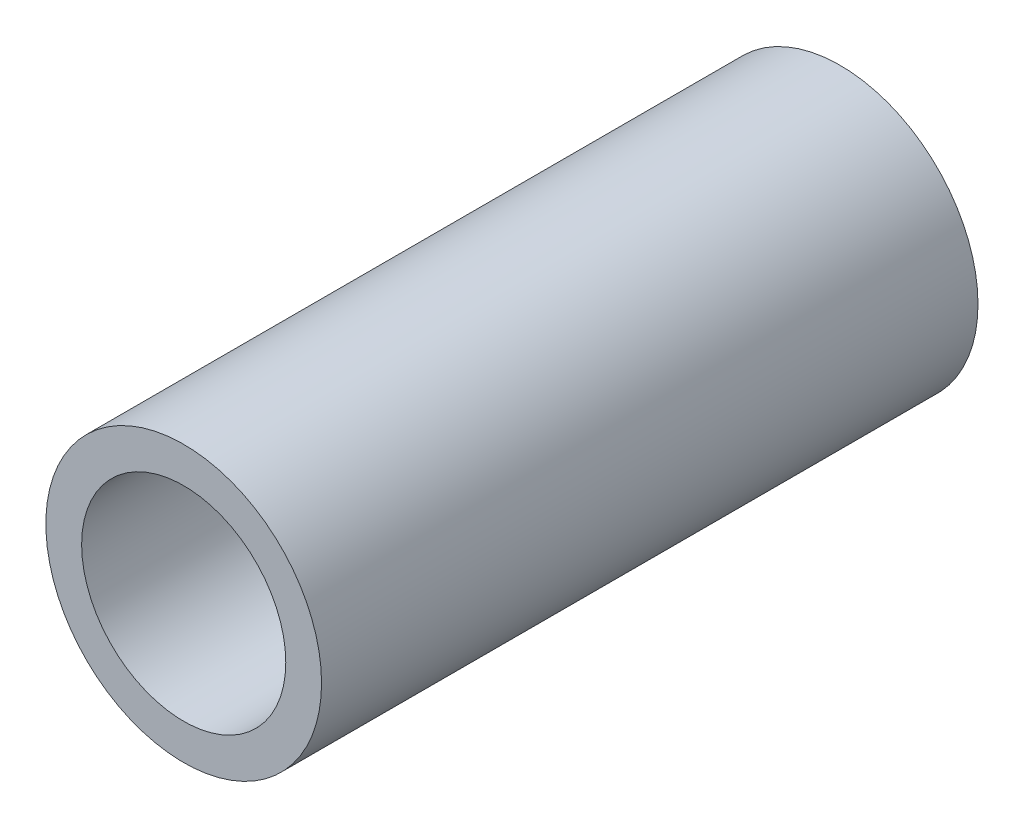
ISO-10303-21;
HEADER;
FILE_DESCRIPTION(('STEP AP214'),'2;1');
FILE_NAME('part.step','',(''),(''),'','','');
FILE_SCHEMA(('AUTOMOTIVE_DESIGN { 1 0 10303 214 1 1 1 1 }'));
ENDSEC;
DATA;
#1=APPLICATION_CONTEXT('core data for automotive mechanical design processes');
#2=APPLICATION_PROTOCOL_DEFINITION('international standard','automotive_design',2000,#1);
#3=PRODUCT_CONTEXT('',#1,'mechanical');
#4=PRODUCT('Part','Part','',(#3));
#5=PRODUCT_RELATED_PRODUCT_CATEGORY('part','',(#4));
#6=PRODUCT_DEFINITION_FORMATION('','',#4);
#7=PRODUCT_DEFINITION_CONTEXT('part definition',#1,'design');
#8=PRODUCT_DEFINITION('design','',#6,#7);
#9=PRODUCT_DEFINITION_SHAPE('','',#8);
#10=(LENGTH_UNIT() NAMED_UNIT(*) SI_UNIT(.MILLI.,.METRE.));
#11=(NAMED_UNIT(*) PLANE_ANGLE_UNIT() SI_UNIT($,.RADIAN.));
#12=(NAMED_UNIT(*) SI_UNIT($,.STERADIAN.) SOLID_ANGLE_UNIT());
#13=UNCERTAINTY_MEASURE_WITH_UNIT(LENGTH_MEASURE(1.E-05),#10,'distance_accuracy_value','');
#14=(GEOMETRIC_REPRESENTATION_CONTEXT(3) GLOBAL_UNCERTAINTY_ASSIGNED_CONTEXT((#13)) GLOBAL_UNIT_ASSIGNED_CONTEXT((#10,
#11,#12)) REPRESENTATION_CONTEXT('',''));
#15=CARTESIAN_POINT('',(0.,0.,0.));
#16=DIRECTION('',(0.,0.,1.));
#17=DIRECTION('',(1.,0.,0.));
#18=AXIS2_PLACEMENT_3D('',#15,#16,#17);
#19=CARTESIAN_POINT('',(0.,0.,50.8));
#20=DIRECTION('',(0.,0.,1.));
#21=DIRECTION('',(1.,0.,0.));
#22=AXIS2_PLACEMENT_3D('',#19,#20,#21);
#23=PLANE('',#22);
#24=CARTESIAN_POINT('',(0.,0.,50.8));
#25=DIRECTION('',(0.,0.,1.));
#26=DIRECTION('',(1.,0.,0.));
#27=AXIS2_PLACEMENT_3D('',#24,#25,#26);
#28=CIRCLE('',#27,10.668);
#29=CARTESIAN_POINT('',(10.668,0.,50.8));
#30=VERTEX_POINT('',#29);
#31=EDGE_CURVE('E10',#30,#30,#28,.T.);
#32=ORIENTED_EDGE('',*,*,#31,.T.);
#33=EDGE_LOOP('',(#32));
#34=FACE_BOUND('',#33,.T.);
#35=CARTESIAN_POINT('',(0.,0.,50.8));
#36=DIRECTION('',(0.,0.,1.));
#37=DIRECTION('',(1.,0.,0.));
#38=AXIS2_PLACEMENT_3D('',#35,#36,#37);
#39=CIRCLE('',#38,7.8994);
#40=CARTESIAN_POINT('',(7.8994,0.,50.8));
#41=VERTEX_POINT('',#40);
#42=EDGE_CURVE('E42',#41,#41,#39,.T.);
#43=ORIENTED_EDGE('',*,*,#42,.F.);
#44=EDGE_LOOP('',(#43));
#45=FACE_BOUND('',#44,.T.);
#46=ADVANCED_FACE('F31',(#34,#45),#23,.T.);
#47=CARTESIAN_POINT('',(0.,0.,0.));
#48=DIRECTION('',(0.,0.,1.));
#49=DIRECTION('',(1.,0.,0.));
#50=AXIS2_PLACEMENT_3D('',#47,#48,#49);
#51=PLANE('',#50);
#52=CARTESIAN_POINT('',(0.,0.,0.));
#53=DIRECTION('',(0.,0.,1.));
#54=DIRECTION('',(1.,0.,0.));
#55=AXIS2_PLACEMENT_3D('',#52,#53,#54);
#56=CIRCLE('',#55,10.668);
#57=CARTESIAN_POINT('',(10.668,0.,0.));
#58=VERTEX_POINT('',#57);
#59=EDGE_CURVE('E35',#58,#58,#56,.T.);
#60=ORIENTED_EDGE('',*,*,#59,.F.);
#61=EDGE_LOOP('',(#60));
#62=FACE_BOUND('',#61,.T.);
#63=CARTESIAN_POINT('',(0.,0.,0.));
#64=DIRECTION('',(0.,0.,1.));
#65=DIRECTION('',(1.,0.,0.));
#66=AXIS2_PLACEMENT_3D('',#63,#64,#65);
#67=CIRCLE('',#66,7.8994);
#68=CARTESIAN_POINT('',(7.8994,0.,0.));
#69=VERTEX_POINT('',#68);
#70=EDGE_CURVE('E44',#69,#69,#67,.T.);
#71=ORIENTED_EDGE('',*,*,#70,.T.);
#72=EDGE_LOOP('',(#71));
#73=FACE_BOUND('',#72,.T.);
#74=ADVANCED_FACE('F54',(#62,#73),#51,.F.);
#75=CARTESIAN_POINT('',(0.,0.,50.8));
#76=DIRECTION('',(0.,0.,-1.));
#77=DIRECTION('',(-1.,0.,0.));
#78=AXIS2_PLACEMENT_3D('',#75,#76,#77);
#79=CYLINDRICAL_SURFACE('',#78,10.668);
#80=ORIENTED_EDGE('',*,*,#31,.F.);
#81=EDGE_LOOP('',(#80));
#82=FACE_BOUND('',#81,.T.);
#83=ORIENTED_EDGE('',*,*,#59,.T.);
#84=EDGE_LOOP('',(#83));
#85=FACE_BOUND('',#84,.T.);
#86=ADVANCED_FACE('F33',(#82,#85),#79,.T.);
#87=CARTESIAN_POINT('',(0.,0.,50.8));
#88=DIRECTION('',(0.,0.,-1.));
#89=DIRECTION('',(-1.,0.,0.));
#90=AXIS2_PLACEMENT_3D('',#87,#88,#89);
#91=CYLINDRICAL_SURFACE('',#90,7.8994);
#92=ORIENTED_EDGE('',*,*,#42,.T.);
#93=EDGE_LOOP('',(#92));
#94=FACE_BOUND('',#93,.T.);
#95=ORIENTED_EDGE('',*,*,#70,.F.);
#96=EDGE_LOOP('',(#95));
#97=FACE_BOUND('',#96,.T.);
#98=ADVANCED_FACE('F50',(#94,#97),#91,.F.);
#99=CLOSED_SHELL('',(#46,#74,#86,#98));
#100=MANIFOLD_SOLID_BREP('B2',#99);
#101=ADVANCED_BREP_SHAPE_REPRESENTATION('',(#18,#100),#14);
#102=SHAPE_DEFINITION_REPRESENTATION(#9,#101);
ENDSEC;
END-ISO-10303-21;
